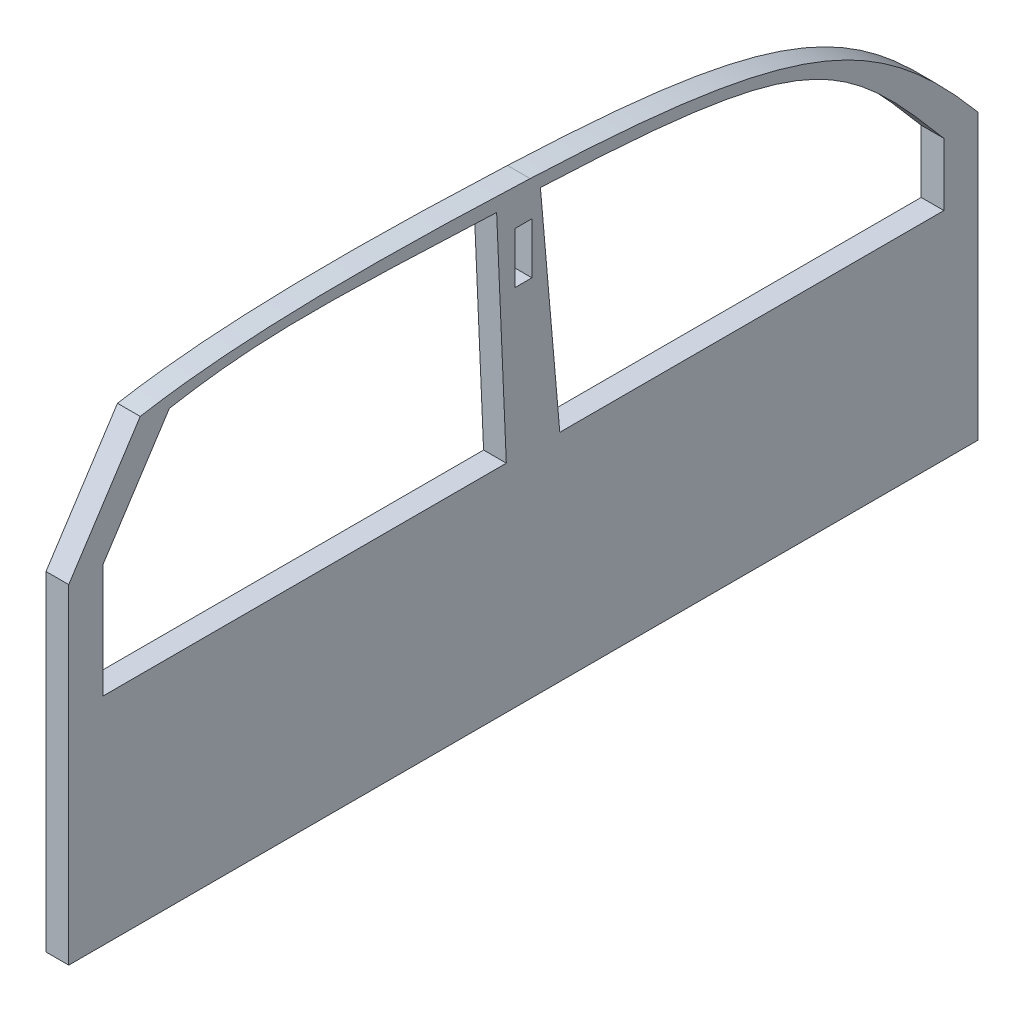
ISO-10303-21;
HEADER;
FILE_DESCRIPTION(('STEP AP214'),'2;1');
FILE_NAME('part.step','',(''),(''),'','','');
FILE_SCHEMA(('AUTOMOTIVE_DESIGN { 1 0 10303 214 1 1 1 1 }'));
ENDSEC;
DATA;
#1=APPLICATION_CONTEXT('core data for automotive mechanical design processes');
#2=APPLICATION_PROTOCOL_DEFINITION('international standard','automotive_design',2000,#1);
#3=PRODUCT_CONTEXT('',#1,'mechanical');
#4=PRODUCT('Part','Part','',(#3));
#5=PRODUCT_RELATED_PRODUCT_CATEGORY('part','',(#4));
#6=PRODUCT_DEFINITION_FORMATION('','',#4);
#7=PRODUCT_DEFINITION_CONTEXT('part definition',#1,'design');
#8=PRODUCT_DEFINITION('design','',#6,#7);
#9=PRODUCT_DEFINITION_SHAPE('','',#8);
#10=(LENGTH_UNIT() NAMED_UNIT(*) SI_UNIT(.MILLI.,.METRE.));
#11=(NAMED_UNIT(*) PLANE_ANGLE_UNIT() SI_UNIT($,.RADIAN.));
#12=(NAMED_UNIT(*) SI_UNIT($,.STERADIAN.) SOLID_ANGLE_UNIT());
#13=UNCERTAINTY_MEASURE_WITH_UNIT(LENGTH_MEASURE(1.E-05),#10,'distance_accuracy_value','');
#14=(GEOMETRIC_REPRESENTATION_CONTEXT(3) GLOBAL_UNCERTAINTY_ASSIGNED_CONTEXT((#13)) GLOBAL_UNIT_ASSIGNED_CONTEXT((#10,
#11,#12)) REPRESENTATION_CONTEXT('',''));
#15=CARTESIAN_POINT('',(0.,0.,0.));
#16=DIRECTION('',(0.,0.,1.));
#17=DIRECTION('',(1.,0.,0.));
#18=AXIS2_PLACEMENT_3D('',#15,#16,#17);
#19=CARTESIAN_POINT('',(20.,96.9820660612688,-639.797203166535));
#20=DIRECTION('',(-1.,0.,0.));
#21=DIRECTION('',(0.,0.,1.));
#22=AXIS2_PLACEMENT_3D('',#19,#20,#21);
#23=PLANE('',#22);
#24=CARTESIAN_POINT('',(20.,-17.5989403553096,-753.140187426739));
#25=CARTESIAN_POINT('',(20.,89.647281681347,-663.149922070623));
#26=CARTESIAN_POINT('',(20.,112.22320259278,-631.251439129172));
#27=CARTESIAN_POINT('',(20.,122.40105964469,-398.140187426738));
#28=B_SPLINE_CURVE_WITH_KNOTS('',3,(#24,#25,#26,#27),.UNSPECIFIED.,.F.,.F.,(4,4),
(0.0277357335730813,0.842070205707386),.UNSPECIFIED.);
#29=CARTESIAN_POINT('',(20.,-17.5989403553107,-753.140187426739));
#30=VERTEX_POINT('',#29);
#31=CARTESIAN_POINT('',(20.,122.401059644689,-398.140187426738));
#32=VERTEX_POINT('',#31);
#33=EDGE_CURVE('E221',#30,#32,#28,.T.);
#34=ORIENTED_EDGE('',*,*,#33,.F.);
#35=DIRECTION('',(0.,1.,0.));
#36=VECTOR('',#35,1.);
#37=CARTESIAN_POINT('',(20.,-72.5989403553107,-753.140187426738));
#38=LINE('',#37,#36);
#39=CARTESIAN_POINT('',(20.,-72.5989403553107,-753.140187426738));
#40=VERTEX_POINT('',#39);
#41=EDGE_CURVE('E536',#40,#30,#38,.T.);
#42=ORIENTED_EDGE('',*,*,#41,.F.);
#43=DIRECTION('',(0.,0.,-1.));
#44=VECTOR('',#43,1.);
#45=CARTESIAN_POINT('',(20.,-72.5989403553107,-753.140187426738));
#46=LINE('',#45,#44);
#47=CARTESIAN_POINT('',(20.,-72.5989403553107,-415.200476814294));
#48=VERTEX_POINT('',#47);
#49=EDGE_CURVE('E589',#48,#40,#46,.T.);
#50=ORIENTED_EDGE('',*,*,#49,.F.);
#51=DIRECTION('',(0.,-0.996194698091745,-0.0871557427476617));
#52=VECTOR('',#51,1.);
#53=CARTESIAN_POINT('',(20.,122.401059644689,-398.140187426738));
#54=LINE('',#53,#52);
#55=EDGE_CURVE('E226',#32,#48,#54,.T.);
#56=ORIENTED_EDGE('',*,*,#55,.F.);
#57=EDGE_LOOP('',(#34,#42,#50,#56));
#58=FACE_BOUND('',#57,.T.);
#59=CARTESIAN_POINT('',(20.,-12.5989403553096,-783.140187426738));
#60=CARTESIAN_POINT('',(20.,94.6472816813481,-693.149922070623));
#61=CARTESIAN_POINT('',(20.,123.583941687376,-622.224730849026));
#62=CARTESIAN_POINT('',(20.,133.761798739289,-389.113479146589));
#63=B_SPLINE_CURVE_WITH_KNOTS('',3,(#59,#60,#61,#62),.UNSPECIFIED.,.F.,.F.,(4,4),(0.,1.),.UNSPECIFIED.);
#64=CARTESIAN_POINT('',(20.,-12.5989403553107,-783.140187426738));
#65=VERTEX_POINT('',#64);
#66=CARTESIAN_POINT('',(20.,133.761798739289,-389.11347914659));
#67=VERTEX_POINT('',#66);
#68=EDGE_CURVE('E288',#65,#67,#63,.T.);
#69=ORIENTED_EDGE('',*,*,#68,.T.);
#70=CARTESIAN_POINT('',(20.,133.761798739289,-389.11347914659));
#71=CARTESIAN_POINT('',(20.,140.304706844089,-239.256245909311));
#72=CARTESIAN_POINT('',(20.,138.567511957119,-128.104345717138));
#73=CARTESIAN_POINT('',(20.,124.096830484874,-46.0370329661208));
#74=B_SPLINE_CURVE_WITH_KNOTS('',3,(#70,#71,#72,#73),.UNSPECIFIED.,.F.,.F.,(4,4),(0.,1.),.UNSPECIFIED.);
#75=CARTESIAN_POINT('',(20.,124.096830484874,-46.0370329661208));
#76=VERTEX_POINT('',#75);
#77=EDGE_CURVE('E282',#67,#76,#74,.T.);
#78=ORIENTED_EDGE('',*,*,#77,.T.);
#79=DIRECTION('',(0.,-0.838266920822379,0.545260093400359));
#80=VECTOR('',#79,1.);
#81=CARTESIAN_POINT('',(20.,124.096830484874,-46.0370329661208));
#82=LINE('',#81,#80);
#83=CARTESIAN_POINT('',(20.,27.4010596446893,16.8598125732616));
#84=VERTEX_POINT('',#83);
#85=EDGE_CURVE('E287',#76,#84,#82,.T.);
#86=ORIENTED_EDGE('',*,*,#85,.T.);
#87=DIRECTION('',(0.,-1.,0.));
#88=VECTOR('',#87,1.);
#89=CARTESIAN_POINT('',(20.,27.4010596446893,16.8598125732616));
#90=LINE('',#89,#88);
#91=CARTESIAN_POINT('',(20.,-262.598940355311,16.8598125732616));
#92=VERTEX_POINT('',#91);
#93=EDGE_CURVE('E297',#84,#92,#90,.T.);
#94=ORIENTED_EDGE('',*,*,#93,.T.);
#95=DIRECTION('',(0.,0.,-1.));
#96=VECTOR('',#95,1.);
#97=CARTESIAN_POINT('',(20.,-262.598940355311,16.8598125732616));
#98=LINE('',#97,#96);
#99=CARTESIAN_POINT('',(20.,-262.598940355311,-783.140187426738));
#100=VERTEX_POINT('',#99);
#101=EDGE_CURVE('E299',#92,#100,#98,.T.);
#102=ORIENTED_EDGE('',*,*,#101,.T.);
#103=DIRECTION('',(0.,1.,0.));
#104=VECTOR('',#103,1.);
#105=CARTESIAN_POINT('',(20.,-262.598940355311,-783.140187426738));
#106=LINE('',#105,#104);
#107=EDGE_CURVE('E301',#100,#65,#106,.T.);
#108=ORIENTED_EDGE('',*,*,#107,.T.);
#109=EDGE_LOOP('',(#69,#78,#86,#94,#102,#108));
#110=FACE_BOUND('',#109,.T.);
#111=DIRECTION('',(0.,1.,0.));
#112=VECTOR('',#111,1.);
#113=CARTESIAN_POINT('',(20.,102.401059644689,-390.640187426738));
#114=LINE('',#113,#112);
#115=CARTESIAN_POINT('',(20.,57.4010596446893,-390.640187426738));
#116=VERTEX_POINT('',#115);
#117=CARTESIAN_POINT('',(20.,102.401059644689,-390.640187426738));
#118=VERTEX_POINT('',#117);
#119=EDGE_CURVE('E544',#116,#118,#114,.T.);
#120=ORIENTED_EDGE('',*,*,#119,.F.);
#121=DIRECTION('',(0.,0.,-1.));
#122=VECTOR('',#121,1.);
#123=CARTESIAN_POINT('',(20.,57.4010596446893,-390.640187426738));
#124=LINE('',#123,#122);
#125=CARTESIAN_POINT('',(20.,57.4010596446893,-375.640187426738));
#126=VERTEX_POINT('',#125);
#127=EDGE_CURVE('E552',#126,#116,#124,.T.);
#128=ORIENTED_EDGE('',*,*,#127,.F.);
#129=DIRECTION('',(0.,-1.,0.));
#130=VECTOR('',#129,1.);
#131=CARTESIAN_POINT('',(20.,102.401059644689,-375.640187426738));
#132=LINE('',#131,#130);
#133=CARTESIAN_POINT('',(20.,102.401059644689,-375.640187426738));
#134=VERTEX_POINT('',#133);
#135=EDGE_CURVE('E549',#134,#126,#132,.T.);
#136=ORIENTED_EDGE('',*,*,#135,.F.);
#137=DIRECTION('',(0.,0.,1.));
#138=VECTOR('',#137,1.);
#139=CARTESIAN_POINT('',(20.,102.401059644689,-390.640187426738));
#140=LINE('',#139,#138);
#141=EDGE_CURVE('E546',#118,#134,#140,.T.);
#142=ORIENTED_EDGE('',*,*,#141,.F.);
#143=EDGE_LOOP('',(#120,#128,#136,#142));
#144=FACE_BOUND('',#143,.T.);
#145=CARTESIAN_POINT('',(20.,122.688744193192,-359.61374298093));
#146=CARTESIAN_POINT('',(20.,129.231652297992,-209.756509743651));
#147=CARTESIAN_POINT('',(20.,131.871741116934,-153.749006692041));
#148=CARTESIAN_POINT('',(20.,117.40105964469,-71.6816939410232));
#149=B_SPLINE_CURVE_WITH_KNOTS('',3,(#145,#146,#147,#148),.UNSPECIFIED.,.F.,.F.,(4,4),(0.,
0.860293328251261),.UNSPECIFIED.);
#150=CARTESIAN_POINT('',(20.,122.688744193192,-359.61374298093));
#151=VERTEX_POINT('',#150);
#152=CARTESIAN_POINT('',(20.,117.40105964469,-71.6816939410232));
#153=VERTEX_POINT('',#152);
#154=EDGE_CURVE('E169',#151,#153,#149,.T.);
#155=ORIENTED_EDGE('',*,*,#154,.F.);
#156=DIRECTION('',(0.,0.999048221581858,0.04361938736534));
#157=VECTOR('',#156,1.);
#158=CARTESIAN_POINT('',(20.,122.688744193192,-359.61374298093));
#159=LINE('',#158,#157);
#160=CARTESIAN_POINT('',(20.,-72.5989403553107,-368.140187426738));
#161=VERTEX_POINT('',#160);
#162=EDGE_CURVE('E199',#161,#151,#159,.T.);
#163=ORIENTED_EDGE('',*,*,#162,.F.);
#164=DIRECTION('',(0.,0.,-1.));
#165=VECTOR('',#164,1.);
#166=CARTESIAN_POINT('',(20.,-72.5989403553107,-368.140187426738));
#167=LINE('',#166,#165);
#168=CARTESIAN_POINT('',(20.,-72.5989403553108,-13.1401874267384));
#169=VERTEX_POINT('',#168);
#170=EDGE_CURVE('E192',#169,#161,#167,.T.);
#171=ORIENTED_EDGE('',*,*,#170,.F.);
#172=DIRECTION('',(0.,-1.,0.));
#173=VECTOR('',#172,1.);
#174=CARTESIAN_POINT('',(20.,27.4010596446892,-13.1401874267384));
#175=LINE('',#174,#173);
#176=CARTESIAN_POINT('',(20.,27.4010596446892,-13.1401874267384));
#177=VERTEX_POINT('',#176);
#178=EDGE_CURVE('E190',#177,#169,#175,.T.);
#179=ORIENTED_EDGE('',*,*,#178,.F.);
#180=DIRECTION('',(0.,-0.838266920822379,0.545260093400358));
#181=VECTOR('',#180,1.);
#182=CARTESIAN_POINT('',(20.,117.40105964469,-71.6816939410232));
#183=LINE('',#182,#181);
#184=EDGE_CURVE('E177',#153,#177,#183,.T.);
#185=ORIENTED_EDGE('',*,*,#184,.F.);
#186=EDGE_LOOP('',(#155,#163,#171,#179,#185));
#187=FACE_BOUND('',#186,.T.);
#188=ADVANCED_FACE('F37',(#58,#110,#144,#187),#23,.F.);
#189=CARTESIAN_POINT('',(0.,96.9820660612688,-639.797203166535));
#190=DIRECTION('',(-1.,0.,0.));
#191=DIRECTION('',(0.,0.,1.));
#192=AXIS2_PLACEMENT_3D('',#189,#190,#191);
#193=PLANE('',#192);
#194=CARTESIAN_POINT('',(0.,-12.5989403553096,-783.140187426738));
#195=CARTESIAN_POINT('',(0.,94.6472816813481,-693.149922070623));
#196=CARTESIAN_POINT('',(0.,123.583941687376,-622.224730849026));
#197=CARTESIAN_POINT('',(0.,133.761798739289,-389.113479146589));
#198=B_SPLINE_CURVE_WITH_KNOTS('',3,(#194,#195,#196,#197),.UNSPECIFIED.,.F.,.F.,(4,4),(0.,1.),.UNSPECIFIED.);
#199=CARTESIAN_POINT('',(0.,-12.5989403553107,-783.140187426738));
#200=VERTEX_POINT('',#199);
#201=CARTESIAN_POINT('',(0.,133.761798739289,-389.11347914659));
#202=VERTEX_POINT('',#201);
#203=EDGE_CURVE('E304',#200,#202,#198,.T.);
#204=ORIENTED_EDGE('',*,*,#203,.F.);
#205=DIRECTION('',(0.,1.,0.));
#206=VECTOR('',#205,1.);
#207=CARTESIAN_POINT('',(0.,-262.598940355311,-783.140187426738));
#208=LINE('',#207,#206);
#209=CARTESIAN_POINT('',(0.,-262.598940355311,-783.140187426738));
#210=VERTEX_POINT('',#209);
#211=EDGE_CURVE('E326',#210,#200,#208,.T.);
#212=ORIENTED_EDGE('',*,*,#211,.F.);
#213=DIRECTION('',(0.,0.,-1.));
#214=VECTOR('',#213,1.);
#215=CARTESIAN_POINT('',(0.,-262.598940355311,16.8598125732616));
#216=LINE('',#215,#214);
#217=CARTESIAN_POINT('',(0.,-262.598940355311,16.8598125732616));
#218=VERTEX_POINT('',#217);
#219=EDGE_CURVE('E324',#218,#210,#216,.T.);
#220=ORIENTED_EDGE('',*,*,#219,.F.);
#221=DIRECTION('',(0.,-1.,0.));
#222=VECTOR('',#221,1.);
#223=CARTESIAN_POINT('',(0.,27.4010596446893,16.8598125732616));
#224=LINE('',#223,#222);
#225=CARTESIAN_POINT('',(0.,27.4010596446893,16.8598125732616));
#226=VERTEX_POINT('',#225);
#227=EDGE_CURVE('E322',#226,#218,#224,.T.);
#228=ORIENTED_EDGE('',*,*,#227,.F.);
#229=DIRECTION('',(0.,-0.838266920822379,0.545260093400359));
#230=VECTOR('',#229,1.);
#231=CARTESIAN_POINT('',(0.,124.096830484874,-46.0370329661208));
#232=LINE('',#231,#230);
#233=CARTESIAN_POINT('',(0.,124.096830484874,-46.0370329661208));
#234=VERTEX_POINT('',#233);
#235=EDGE_CURVE('E317',#234,#226,#232,.T.);
#236=ORIENTED_EDGE('',*,*,#235,.F.);
#237=CARTESIAN_POINT('',(0.,133.761798739289,-389.11347914659));
#238=CARTESIAN_POINT('',(0.,140.304706844089,-239.256245909311));
#239=CARTESIAN_POINT('',(0.,138.567511957119,-128.104345717138));
#240=CARTESIAN_POINT('',(0.,124.096830484874,-46.0370329661208));
#241=B_SPLINE_CURVE_WITH_KNOTS('',3,(#237,#238,#239,#240),.UNSPECIFIED.,.F.,.F.,(4,4),(0.,1.),.UNSPECIFIED.);
#242=EDGE_CURVE('E309',#202,#234,#241,.T.);
#243=ORIENTED_EDGE('',*,*,#242,.F.);
#244=EDGE_LOOP('',(#204,#212,#220,#228,#236,#243));
#245=FACE_BOUND('',#244,.T.);
#246=DIRECTION('',(0.,0.,-1.));
#247=VECTOR('',#246,1.);
#248=CARTESIAN_POINT('',(0.,57.4010596446893,-390.640187426738));
#249=LINE('',#248,#247);
#250=CARTESIAN_POINT('',(0.,57.4010596446893,-375.640187426738));
#251=VERTEX_POINT('',#250);
#252=CARTESIAN_POINT('',(0.,57.4010596446893,-390.640187426738));
#253=VERTEX_POINT('',#252);
#254=EDGE_CURVE('E547',#251,#253,#249,.T.);
#255=ORIENTED_EDGE('',*,*,#254,.T.);
#256=DIRECTION('',(0.,1.,0.));
#257=VECTOR('',#256,1.);
#258=CARTESIAN_POINT('',(0.,102.401059644689,-390.640187426738));
#259=LINE('',#258,#257);
#260=CARTESIAN_POINT('',(0.,102.401059644689,-390.640187426738));
#261=VERTEX_POINT('',#260);
#262=EDGE_CURVE('E543',#253,#261,#259,.T.);
#263=ORIENTED_EDGE('',*,*,#262,.T.);
#264=DIRECTION('',(0.,0.,1.));
#265=VECTOR('',#264,1.);
#266=CARTESIAN_POINT('',(0.,102.401059644689,-390.640187426738));
#267=LINE('',#266,#265);
#268=CARTESIAN_POINT('',(0.,102.401059644689,-375.640187426738));
#269=VERTEX_POINT('',#268);
#270=EDGE_CURVE('E557',#261,#269,#267,.T.);
#271=ORIENTED_EDGE('',*,*,#270,.T.);
#272=DIRECTION('',(0.,-1.,0.));
#273=VECTOR('',#272,1.);
#274=CARTESIAN_POINT('',(0.,102.401059644689,-375.640187426738));
#275=LINE('',#274,#273);
#276=EDGE_CURVE('E560',#269,#251,#275,.T.);
#277=ORIENTED_EDGE('',*,*,#276,.T.);
#278=EDGE_LOOP('',(#255,#263,#271,#277));
#279=FACE_BOUND('',#278,.T.);
#280=DIRECTION('',(0.,1.,0.));
#281=VECTOR('',#280,1.);
#282=CARTESIAN_POINT('',(0.,-72.5989403553107,-753.140187426738));
#283=LINE('',#282,#281);
#284=CARTESIAN_POINT('',(0.,-72.5989403553107,-753.140187426738));
#285=VERTEX_POINT('',#284);
#286=CARTESIAN_POINT('',(0.,-17.5989403553107,-753.140187426739));
#287=VERTEX_POINT('',#286);
#288=EDGE_CURVE('E227',#285,#287,#283,.T.);
#289=ORIENTED_EDGE('',*,*,#288,.T.);
#290=CARTESIAN_POINT('',(0.,-17.5989403553096,-753.140187426739));
#291=CARTESIAN_POINT('',(0.,89.647281681347,-663.149922070623));
#292=CARTESIAN_POINT('',(0.,112.22320259278,-631.251439129172));
#293=CARTESIAN_POINT('',(0.,122.40105964469,-398.140187426738));
#294=B_SPLINE_CURVE_WITH_KNOTS('',3,(#290,#291,#292,#293),.UNSPECIFIED.,.F.,.F.,(4,4),
(0.0277357335730813,0.842070205707386),.UNSPECIFIED.);
#295=CARTESIAN_POINT('',(0.,122.401059644689,-398.140187426738));
#296=VERTEX_POINT('',#295);
#297=EDGE_CURVE('E185',#287,#296,#294,.T.);
#298=ORIENTED_EDGE('',*,*,#297,.T.);
#299=DIRECTION('',(0.,-0.996194698091745,-0.0871557427476617));
#300=VECTOR('',#299,1.);
#301=CARTESIAN_POINT('',(0.,122.401059644689,-398.140187426738));
#302=LINE('',#301,#300);
#303=CARTESIAN_POINT('',(0.,-72.5989403553107,-415.200476814294));
#304=VERTEX_POINT('',#303);
#305=EDGE_CURVE('E529',#296,#304,#302,.T.);
#306=ORIENTED_EDGE('',*,*,#305,.T.);
#307=DIRECTION('',(0.,0.,-1.));
#308=VECTOR('',#307,1.);
#309=CARTESIAN_POINT('',(0.,-72.5989403553107,-753.140187426738));
#310=LINE('',#309,#308);
#311=EDGE_CURVE('E525',#304,#285,#310,.T.);
#312=ORIENTED_EDGE('',*,*,#311,.T.);
#313=EDGE_LOOP('',(#289,#298,#306,#312));
#314=FACE_BOUND('',#313,.T.);
#315=DIRECTION('',(0.,0.999048221581858,0.04361938736534));
#316=VECTOR('',#315,1.);
#317=CARTESIAN_POINT('',(0.,122.688744193192,-359.61374298093));
#318=LINE('',#317,#316);
#319=CARTESIAN_POINT('',(0.,-72.5989403553107,-368.140187426738));
#320=VERTEX_POINT('',#319);
#321=CARTESIAN_POINT('',(0.,122.688744193192,-359.61374298093));
#322=VERTEX_POINT('',#321);
#323=EDGE_CURVE('E178',#320,#322,#318,.T.);
#324=ORIENTED_EDGE('',*,*,#323,.T.);
#325=CARTESIAN_POINT('',(0.,122.688744193192,-359.61374298093));
#326=CARTESIAN_POINT('',(0.,129.231652297992,-209.756509743651));
#327=CARTESIAN_POINT('',(0.,131.871741116934,-153.749006692041));
#328=CARTESIAN_POINT('',(0.,117.40105964469,-71.6816939410232));
#329=B_SPLINE_CURVE_WITH_KNOTS('',3,(#325,#326,#327,#328),.UNSPECIFIED.,.F.,.F.,(4,4),(0.,
0.860293328251261),.UNSPECIFIED.);
#330=CARTESIAN_POINT('',(0.,117.40105964469,-71.6816939410232));
#331=VERTEX_POINT('',#330);
#332=EDGE_CURVE('E61',#322,#331,#329,.T.);
#333=ORIENTED_EDGE('',*,*,#332,.T.);
#334=DIRECTION('',(0.,-0.838266920822379,0.545260093400358));
#335=VECTOR('',#334,1.);
#336=CARTESIAN_POINT('',(0.,117.40105964469,-71.6816939410232));
#337=LINE('',#336,#335);
#338=CARTESIAN_POINT('',(0.,27.4010596446892,-13.1401874267384));
#339=VERTEX_POINT('',#338);
#340=EDGE_CURVE('E184',#331,#339,#337,.T.);
#341=ORIENTED_EDGE('',*,*,#340,.T.);
#342=DIRECTION('',(0.,-1.,0.));
#343=VECTOR('',#342,1.);
#344=CARTESIAN_POINT('',(0.,27.4010596446892,-13.1401874267384));
#345=LINE('',#344,#343);
#346=CARTESIAN_POINT('',(0.,-72.5989403553108,-13.1401874267384));
#347=VERTEX_POINT('',#346);
#348=EDGE_CURVE('E208',#339,#347,#345,.T.);
#349=ORIENTED_EDGE('',*,*,#348,.T.);
#350=DIRECTION('',(0.,0.,-1.));
#351=VECTOR('',#350,1.);
#352=CARTESIAN_POINT('',(0.,-72.5989403553107,-368.140187426738));
#353=LINE('',#352,#351);
#354=EDGE_CURVE('E211',#347,#320,#353,.T.);
#355=ORIENTED_EDGE('',*,*,#354,.T.);
#356=EDGE_LOOP('',(#324,#333,#341,#349,#355));
#357=FACE_BOUND('',#356,.T.);
#358=ADVANCED_FACE('F259',(#245,#279,#314,#357),#193,.T.);
#359=DIRECTION('',(-1.,0.,0.));
#360=VECTOR('',#359,1.);
#361=SURFACE_OF_LINEAR_EXTRUSION('',#63,#360);
#362=ORIENTED_EDGE('',*,*,#203,.T.);
#363=DIRECTION('',(-1.,0.,0.));
#364=VECTOR('',#363,1.);
#365=CARTESIAN_POINT('',(20.,133.761798739289,-389.11347914659));
#366=LINE('',#365,#364);
#367=EDGE_CURVE('E11',#67,#202,#366,.T.);
#368=ORIENTED_EDGE('',*,*,#367,.F.);
#369=ORIENTED_EDGE('',*,*,#68,.F.);
#370=DIRECTION('',(-1.,0.,0.));
#371=VECTOR('',#370,1.);
#372=CARTESIAN_POINT('',(20.,-12.5989403553107,-783.140187426738));
#373=LINE('',#372,#371);
#374=EDGE_CURVE('E303',#65,#200,#373,.T.);
#375=ORIENTED_EDGE('',*,*,#374,.T.);
#376=EDGE_LOOP('',(#362,#368,#369,#375));
#377=FACE_BOUND('',#376,.T.);
#378=ADVANCED_FACE('F39',(#377),#361,.F.);
#379=DIRECTION('',(-1.,0.,0.));
#380=VECTOR('',#379,1.);
#381=SURFACE_OF_LINEAR_EXTRUSION('',#74,#380);
#382=ORIENTED_EDGE('',*,*,#242,.T.);
#383=DIRECTION('',(-1.,0.,0.));
#384=VECTOR('',#383,1.);
#385=CARTESIAN_POINT('',(20.,124.096830484874,-46.0370329661208));
#386=LINE('',#385,#384);
#387=EDGE_CURVE('E46',#76,#234,#386,.T.);
#388=ORIENTED_EDGE('',*,*,#387,.F.);
#389=ORIENTED_EDGE('',*,*,#77,.F.);
#390=ORIENTED_EDGE('',*,*,#367,.T.);
#391=EDGE_LOOP('',(#382,#388,#389,#390));
#392=FACE_BOUND('',#391,.T.);
#393=ADVANCED_FACE('F277',(#392),#381,.F.);
#394=CARTESIAN_POINT('',(20.,124.096830484874,-46.0370329661208));
#395=DIRECTION('',(0.,-0.545260093400359,-0.838266920822379));
#396=DIRECTION('',(0.,0.838266920822379,-0.545260093400359));
#397=AXIS2_PLACEMENT_3D('',#394,#395,#396);
#398=PLANE('',#397);
#399=ORIENTED_EDGE('',*,*,#235,.T.);
#400=DIRECTION('',(-1.,0.,0.));
#401=VECTOR('',#400,1.);
#402=CARTESIAN_POINT('',(20.,27.4010596446893,16.8598125732616));
#403=LINE('',#402,#401);
#404=EDGE_CURVE('E336',#84,#226,#403,.T.);
#405=ORIENTED_EDGE('',*,*,#404,.F.);
#406=ORIENTED_EDGE('',*,*,#85,.F.);
#407=ORIENTED_EDGE('',*,*,#387,.T.);
#408=EDGE_LOOP('',(#399,#405,#406,#407));
#409=FACE_BOUND('',#408,.T.);
#410=ADVANCED_FACE('F274',(#409),#398,.F.);
#411=CARTESIAN_POINT('',(20.,27.4010596446893,16.8598125732616));
#412=DIRECTION('',(0.,0.,-1.));
#413=DIRECTION('',(0.,1.,0.));
#414=AXIS2_PLACEMENT_3D('',#411,#412,#413);
#415=PLANE('',#414);
#416=ORIENTED_EDGE('',*,*,#227,.T.);
#417=DIRECTION('',(-1.,0.,0.));
#418=VECTOR('',#417,1.);
#419=CARTESIAN_POINT('',(20.,-262.598940355311,16.8598125732616));
#420=LINE('',#419,#418);
#421=EDGE_CURVE('E333',#92,#218,#420,.T.);
#422=ORIENTED_EDGE('',*,*,#421,.F.);
#423=ORIENTED_EDGE('',*,*,#93,.F.);
#424=ORIENTED_EDGE('',*,*,#404,.T.);
#425=EDGE_LOOP('',(#416,#422,#423,#424));
#426=FACE_BOUND('',#425,.T.);
#427=ADVANCED_FACE('F270',(#426),#415,.F.);
#428=CARTESIAN_POINT('',(20.,-262.598940355311,16.8598125732616));
#429=DIRECTION('',(0.,1.,0.));
#430=DIRECTION('',(0.,0.,1.));
#431=AXIS2_PLACEMENT_3D('',#428,#429,#430);
#432=PLANE('',#431);
#433=ORIENTED_EDGE('',*,*,#219,.T.);
#434=DIRECTION('',(-1.,0.,0.));
#435=VECTOR('',#434,1.);
#436=CARTESIAN_POINT('',(20.,-262.598940355311,-783.140187426738));
#437=LINE('',#436,#435);
#438=EDGE_CURVE('E330',#100,#210,#437,.T.);
#439=ORIENTED_EDGE('',*,*,#438,.F.);
#440=ORIENTED_EDGE('',*,*,#101,.F.);
#441=ORIENTED_EDGE('',*,*,#421,.T.);
#442=EDGE_LOOP('',(#433,#439,#440,#441));
#443=FACE_BOUND('',#442,.T.);
#444=ADVANCED_FACE('F266',(#443),#432,.F.);
#445=CARTESIAN_POINT('',(20.,-262.598940355311,-783.140187426738));
#446=DIRECTION('',(0.,0.,1.));
#447=DIRECTION('',(1.,0.,0.));
#448=AXIS2_PLACEMENT_3D('',#445,#446,#447);
#449=PLANE('',#448);
#450=ORIENTED_EDGE('',*,*,#211,.T.);
#451=ORIENTED_EDGE('',*,*,#374,.F.);
#452=ORIENTED_EDGE('',*,*,#107,.F.);
#453=ORIENTED_EDGE('',*,*,#438,.T.);
#454=EDGE_LOOP('',(#450,#451,#452,#453));
#455=FACE_BOUND('',#454,.T.);
#456=ADVANCED_FACE('F255',(#455),#449,.F.);
#457=CARTESIAN_POINT('',(20.,102.401059644689,-390.640187426738));
#458=DIRECTION('',(0.,0.,1.));
#459=DIRECTION('',(0.,-1.,0.));
#460=AXIS2_PLACEMENT_3D('',#457,#458,#459);
#461=PLANE('',#460);
#462=ORIENTED_EDGE('',*,*,#262,.F.);
#463=DIRECTION('',(-1.,0.,0.));
#464=VECTOR('',#463,1.);
#465=CARTESIAN_POINT('',(20.,57.4010596446893,-390.640187426738));
#466=LINE('',#465,#464);
#467=EDGE_CURVE('E554',#116,#253,#466,.T.);
#468=ORIENTED_EDGE('',*,*,#467,.F.);
#469=ORIENTED_EDGE('',*,*,#119,.T.);
#470=DIRECTION('',(-1.,0.,0.));
#471=VECTOR('',#470,1.);
#472=CARTESIAN_POINT('',(20.,102.401059644689,-390.640187426738));
#473=LINE('',#472,#471);
#474=EDGE_CURVE('E310',#118,#261,#473,.T.);
#475=ORIENTED_EDGE('',*,*,#474,.T.);
#476=EDGE_LOOP('',(#462,#468,#469,#475));
#477=FACE_BOUND('',#476,.T.);
#478=ADVANCED_FACE('F251',(#477),#461,.T.);
#479=CARTESIAN_POINT('',(20.,102.401059644689,-390.640187426738));
#480=DIRECTION('',(0.,-1.,0.));
#481=DIRECTION('',(0.,0.,-1.));
#482=AXIS2_PLACEMENT_3D('',#479,#480,#481);
#483=PLANE('',#482);
#484=ORIENTED_EDGE('',*,*,#270,.F.);
#485=ORIENTED_EDGE('',*,*,#474,.F.);
#486=ORIENTED_EDGE('',*,*,#141,.T.);
#487=DIRECTION('',(-1.,0.,0.));
#488=VECTOR('',#487,1.);
#489=CARTESIAN_POINT('',(20.,102.401059644689,-375.640187426738));
#490=LINE('',#489,#488);
#491=EDGE_CURVE('E569',#134,#269,#490,.T.);
#492=ORIENTED_EDGE('',*,*,#491,.T.);
#493=EDGE_LOOP('',(#484,#485,#486,#492));
#494=FACE_BOUND('',#493,.T.);
#495=ADVANCED_FACE('F247',(#494),#483,.T.);
#496=CARTESIAN_POINT('',(20.,102.401059644689,-375.640187426738));
#497=DIRECTION('',(0.,0.,-1.));
#498=DIRECTION('',(0.,1.,0.));
#499=AXIS2_PLACEMENT_3D('',#496,#497,#498);
#500=PLANE('',#499);
#501=ORIENTED_EDGE('',*,*,#276,.F.);
#502=ORIENTED_EDGE('',*,*,#491,.F.);
#503=ORIENTED_EDGE('',*,*,#135,.T.);
#504=DIRECTION('',(-1.,0.,0.));
#505=VECTOR('',#504,1.);
#506=CARTESIAN_POINT('',(20.,57.4010596446893,-375.640187426738));
#507=LINE('',#506,#505);
#508=EDGE_CURVE('E567',#126,#251,#507,.T.);
#509=ORIENTED_EDGE('',*,*,#508,.T.);
#510=EDGE_LOOP('',(#501,#502,#503,#509));
#511=FACE_BOUND('',#510,.T.);
#512=ADVANCED_FACE('F243',(#511),#500,.T.);
#513=CARTESIAN_POINT('',(20.,57.4010596446893,-390.640187426738));
#514=DIRECTION('',(0.,1.,0.));
#515=DIRECTION('',(0.,0.,1.));
#516=AXIS2_PLACEMENT_3D('',#513,#514,#515);
#517=PLANE('',#516);
#518=ORIENTED_EDGE('',*,*,#254,.F.);
#519=ORIENTED_EDGE('',*,*,#508,.F.);
#520=ORIENTED_EDGE('',*,*,#127,.T.);
#521=ORIENTED_EDGE('',*,*,#467,.T.);
#522=EDGE_LOOP('',(#518,#519,#520,#521));
#523=FACE_BOUND('',#522,.T.);
#524=ADVANCED_FACE('F238',(#523),#517,.T.);
#525=DIRECTION('',(-1.,0.,0.));
#526=VECTOR('',#525,1.);
#527=SURFACE_OF_LINEAR_EXTRUSION('',#28,#526);
#528=ORIENTED_EDGE('',*,*,#297,.F.);
#529=DIRECTION('',(-1.,0.,0.));
#530=VECTOR('',#529,1.);
#531=CARTESIAN_POINT('',(20.,-17.5989403553107,-753.140187426739));
#532=LINE('',#531,#530);
#533=EDGE_CURVE('E522',#30,#287,#532,.T.);
#534=ORIENTED_EDGE('',*,*,#533,.F.);
#535=ORIENTED_EDGE('',*,*,#33,.T.);
#536=DIRECTION('',(-1.,0.,0.));
#537=VECTOR('',#536,1.);
#538=CARTESIAN_POINT('',(20.,122.401059644689,-398.140187426738));
#539=LINE('',#538,#537);
#540=EDGE_CURVE('E540',#32,#296,#539,.T.);
#541=ORIENTED_EDGE('',*,*,#540,.T.);
#542=EDGE_LOOP('',(#528,#534,#535,#541));
#543=FACE_BOUND('',#542,.T.);
#544=ADVANCED_FACE('F233',(#543),#527,.T.);
#545=CARTESIAN_POINT('',(20.,122.401059644689,-398.140187426738));
#546=DIRECTION('',(0.,0.0871557427476617,-0.996194698091745));
#547=DIRECTION('',(0.,0.996194698091745,0.0871557427476617));
#548=AXIS2_PLACEMENT_3D('',#545,#546,#547);
#549=PLANE('',#548);
#550=ORIENTED_EDGE('',*,*,#305,.F.);
#551=ORIENTED_EDGE('',*,*,#540,.F.);
#552=ORIENTED_EDGE('',*,*,#55,.T.);
#553=DIRECTION('',(-1.,0.,0.));
#554=VECTOR('',#553,1.);
#555=CARTESIAN_POINT('',(20.,-72.5989403553107,-415.200476814294));
#556=LINE('',#555,#554);
#557=EDGE_CURVE('E538',#48,#304,#556,.T.);
#558=ORIENTED_EDGE('',*,*,#557,.T.);
#559=EDGE_LOOP('',(#550,#551,#552,#558));
#560=FACE_BOUND('',#559,.T.);
#561=ADVANCED_FACE('F237',(#560),#549,.T.);
#562=CARTESIAN_POINT('',(20.,-72.5989403553107,-753.140187426738));
#563=DIRECTION('',(0.,1.,0.));
#564=DIRECTION('',(0.,0.,1.));
#565=AXIS2_PLACEMENT_3D('',#562,#563,#564);
#566=PLANE('',#565);
#567=ORIENTED_EDGE('',*,*,#311,.F.);
#568=ORIENTED_EDGE('',*,*,#557,.F.);
#569=ORIENTED_EDGE('',*,*,#49,.T.);
#570=DIRECTION('',(-1.,0.,0.));
#571=VECTOR('',#570,1.);
#572=CARTESIAN_POINT('',(20.,-72.5989403553107,-753.140187426738));
#573=LINE('',#572,#571);
#574=EDGE_CURVE('E519',#40,#285,#573,.T.);
#575=ORIENTED_EDGE('',*,*,#574,.T.);
#576=EDGE_LOOP('',(#567,#568,#569,#575));
#577=FACE_BOUND('',#576,.T.);
#578=ADVANCED_FACE('F411',(#577),#566,.T.);
#579=CARTESIAN_POINT('',(20.,-72.5989403553107,-753.140187426738));
#580=DIRECTION('',(0.,0.,1.));
#581=DIRECTION('',(0.,-1.,0.));
#582=AXIS2_PLACEMENT_3D('',#579,#580,#581);
#583=PLANE('',#582);
#584=ORIENTED_EDGE('',*,*,#288,.F.);
#585=ORIENTED_EDGE('',*,*,#574,.F.);
#586=ORIENTED_EDGE('',*,*,#41,.T.);
#587=ORIENTED_EDGE('',*,*,#533,.T.);
#588=EDGE_LOOP('',(#584,#585,#586,#587));
#589=FACE_BOUND('',#588,.T.);
#590=ADVANCED_FACE('F418',(#589),#583,.T.);
#591=DIRECTION('',(-1.,0.,0.));
#592=VECTOR('',#591,1.);
#593=SURFACE_OF_LINEAR_EXTRUSION('',#149,#592);
#594=ORIENTED_EDGE('',*,*,#332,.F.);
#595=DIRECTION('',(-1.,0.,0.));
#596=VECTOR('',#595,1.);
#597=CARTESIAN_POINT('',(20.,122.688744193192,-359.61374298093));
#598=LINE('',#597,#596);
#599=EDGE_CURVE('E173',#151,#322,#598,.T.);
#600=ORIENTED_EDGE('',*,*,#599,.F.);
#601=ORIENTED_EDGE('',*,*,#154,.T.);
#602=DIRECTION('',(-1.,0.,0.));
#603=VECTOR('',#602,1.);
#604=CARTESIAN_POINT('',(20.,117.40105964469,-71.6816939410232));
#605=LINE('',#604,#603);
#606=EDGE_CURVE('E172',#153,#331,#605,.T.);
#607=ORIENTED_EDGE('',*,*,#606,.T.);
#608=EDGE_LOOP('',(#594,#600,#601,#607));
#609=FACE_BOUND('',#608,.T.);
#610=ADVANCED_FACE('F171',(#609),#593,.T.);
#611=CARTESIAN_POINT('',(20.,117.40105964469,-71.6816939410232));
#612=DIRECTION('',(0.,-0.545260093400358,-0.838266920822379));
#613=DIRECTION('',(0.,0.838266920822379,-0.545260093400358));
#614=AXIS2_PLACEMENT_3D('',#611,#612,#613);
#615=PLANE('',#614);
#616=ORIENTED_EDGE('',*,*,#340,.F.);
#617=ORIENTED_EDGE('',*,*,#606,.F.);
#618=ORIENTED_EDGE('',*,*,#184,.T.);
#619=DIRECTION('',(-1.,0.,0.));
#620=VECTOR('',#619,1.);
#621=CARTESIAN_POINT('',(20.,27.4010596446892,-13.1401874267384));
#622=LINE('',#621,#620);
#623=EDGE_CURVE('E186',#177,#339,#622,.T.);
#624=ORIENTED_EDGE('',*,*,#623,.T.);
#625=EDGE_LOOP('',(#616,#617,#618,#624));
#626=FACE_BOUND('',#625,.T.);
#627=ADVANCED_FACE('F181',(#626),#615,.T.);
#628=CARTESIAN_POINT('',(20.,27.4010596446892,-13.1401874267384));
#629=DIRECTION('',(0.,0.,-1.));
#630=DIRECTION('',(0.,1.,0.));
#631=AXIS2_PLACEMENT_3D('',#628,#629,#630);
#632=PLANE('',#631);
#633=ORIENTED_EDGE('',*,*,#348,.F.);
#634=ORIENTED_EDGE('',*,*,#623,.F.);
#635=ORIENTED_EDGE('',*,*,#178,.T.);
#636=DIRECTION('',(-1.,0.,0.));
#637=VECTOR('',#636,1.);
#638=CARTESIAN_POINT('',(20.,-72.5989403553108,-13.1401874267384));
#639=LINE('',#638,#637);
#640=EDGE_CURVE('E218',#169,#347,#639,.T.);
#641=ORIENTED_EDGE('',*,*,#640,.T.);
#642=EDGE_LOOP('',(#633,#634,#635,#641));
#643=FACE_BOUND('',#642,.T.);
#644=ADVANCED_FACE('F438',(#643),#632,.T.);
#645=CARTESIAN_POINT('',(20.,-72.5989403553107,-368.140187426738));
#646=DIRECTION('',(0.,1.,0.));
#647=DIRECTION('',(0.,0.,1.));
#648=AXIS2_PLACEMENT_3D('',#645,#646,#647);
#649=PLANE('',#648);
#650=ORIENTED_EDGE('',*,*,#354,.F.);
#651=ORIENTED_EDGE('',*,*,#640,.F.);
#652=ORIENTED_EDGE('',*,*,#170,.T.);
#653=DIRECTION('',(-1.,0.,0.));
#654=VECTOR('',#653,1.);
#655=CARTESIAN_POINT('',(20.,-72.5989403553107,-368.140187426738));
#656=LINE('',#655,#654);
#657=EDGE_CURVE('E53',#161,#320,#656,.T.);
#658=ORIENTED_EDGE('',*,*,#657,.T.);
#659=EDGE_LOOP('',(#650,#651,#652,#658));
#660=FACE_BOUND('',#659,.T.);
#661=ADVANCED_FACE('F445',(#660),#649,.T.);
#662=CARTESIAN_POINT('',(20.,122.688744193192,-359.61374298093));
#663=DIRECTION('',(0.,-0.04361938736534,0.999048221581858));
#664=DIRECTION('',(0.,-0.999048221581858,-0.04361938736534));
#665=AXIS2_PLACEMENT_3D('',#662,#663,#664);
#666=PLANE('',#665);
#667=ORIENTED_EDGE('',*,*,#323,.F.);
#668=ORIENTED_EDGE('',*,*,#657,.F.);
#669=ORIENTED_EDGE('',*,*,#162,.T.);
#670=ORIENTED_EDGE('',*,*,#599,.T.);
#671=EDGE_LOOP('',(#667,#668,#669,#670));
#672=FACE_BOUND('',#671,.T.);
#673=ADVANCED_FACE('F453',(#672),#666,.T.);
#674=CLOSED_SHELL('',(#188,#358,#378,#393,#410,#427,#444,#456,#478,#495,#512,#524,#544,#561,
#578,#590,#610,#627,#644,#661,#673));
#675=MANIFOLD_SOLID_BREP('B2',#674);
#676=ADVANCED_BREP_SHAPE_REPRESENTATION('',(#18,#675),#14);
#677=SHAPE_DEFINITION_REPRESENTATION(#9,#676);
ENDSEC;
END-ISO-10303-21;
